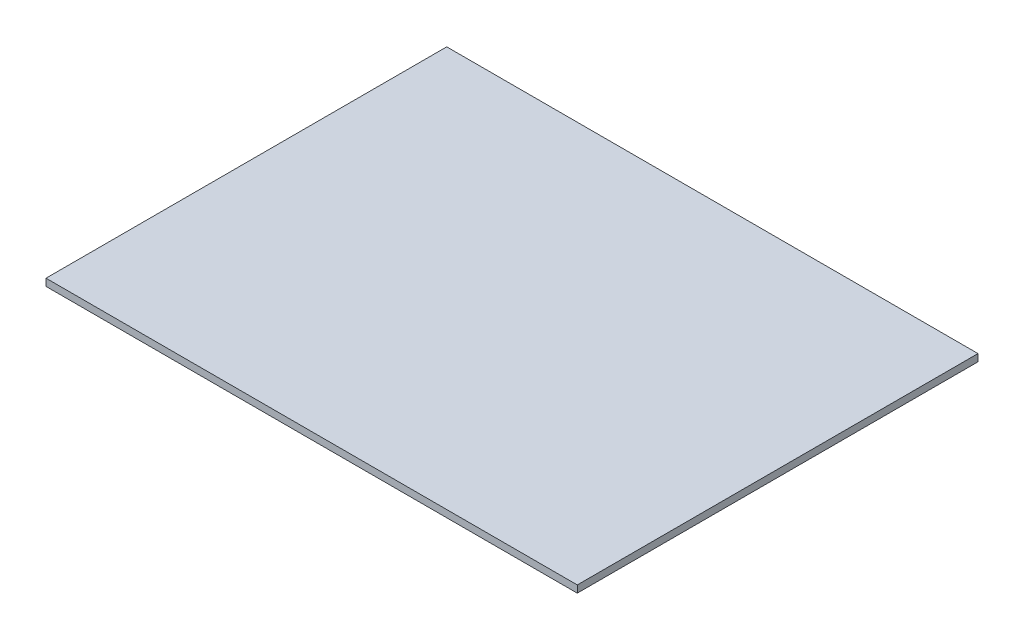
ISO-10303-21;
HEADER;
FILE_DESCRIPTION(('STEP AP214'),'2;1');
FILE_NAME('part.step','',(''),(''),'','','');
FILE_SCHEMA(('AUTOMOTIVE_DESIGN { 1 0 10303 214 1 1 1 1 }'));
ENDSEC;
DATA;
#1=APPLICATION_CONTEXT('core data for automotive mechanical design processes');
#2=APPLICATION_PROTOCOL_DEFINITION('international standard','automotive_design',2000,#1);
#3=PRODUCT_CONTEXT('',#1,'mechanical');
#4=PRODUCT('Part','Part','',(#3));
#5=PRODUCT_RELATED_PRODUCT_CATEGORY('part','',(#4));
#6=PRODUCT_DEFINITION_FORMATION('','',#4);
#7=PRODUCT_DEFINITION_CONTEXT('part definition',#1,'design');
#8=PRODUCT_DEFINITION('design','',#6,#7);
#9=PRODUCT_DEFINITION_SHAPE('','',#8);
#10=(LENGTH_UNIT() NAMED_UNIT(*) SI_UNIT(.MILLI.,.METRE.));
#11=(NAMED_UNIT(*) PLANE_ANGLE_UNIT() SI_UNIT($,.RADIAN.));
#12=(NAMED_UNIT(*) SI_UNIT($,.STERADIAN.) SOLID_ANGLE_UNIT());
#13=UNCERTAINTY_MEASURE_WITH_UNIT(LENGTH_MEASURE(1.E-05),#10,'distance_accuracy_value','');
#14=(GEOMETRIC_REPRESENTATION_CONTEXT(3) GLOBAL_UNCERTAINTY_ASSIGNED_CONTEXT((#13)) GLOBAL_UNIT_ASSIGNED_CONTEXT((#10,
#11,#12)) REPRESENTATION_CONTEXT('',''));
#15=CARTESIAN_POINT('',(0.,0.,0.));
#16=DIRECTION('',(0.,0.,1.));
#17=DIRECTION('',(1.,0.,0.));
#18=AXIS2_PLACEMENT_3D('',#15,#16,#17);
#19=CARTESIAN_POINT('',(0.,6.,0.));
#20=DIRECTION('',(1.,0.,0.));
#21=DIRECTION('',(0.,0.,-1.));
#22=AXIS2_PLACEMENT_3D('',#19,#20,#21);
#23=PLANE('',#22);
#24=DIRECTION('',(0.,0.,1.));
#25=VECTOR('',#24,1.);
#26=CARTESIAN_POINT('',(0.,0.,0.));
#27=LINE('',#26,#25);
#28=CARTESIAN_POINT('',(0.,0.,-336.4));
#29=VERTEX_POINT('',#28);
#30=CARTESIAN_POINT('',(0.,0.,0.));
#31=VERTEX_POINT('',#30);
#32=EDGE_CURVE('E114',#29,#31,#27,.T.);
#33=ORIENTED_EDGE('',*,*,#32,.T.);
#34=DIRECTION('',(0.,-1.,0.));
#35=VECTOR('',#34,1.);
#36=CARTESIAN_POINT('',(0.,6.,0.));
#37=LINE('',#36,#35);
#38=CARTESIAN_POINT('',(0.,6.,0.));
#39=VERTEX_POINT('',#38);
#40=EDGE_CURVE('E11',#39,#31,#37,.T.);
#41=ORIENTED_EDGE('',*,*,#40,.F.);
#42=DIRECTION('',(0.,0.,1.));
#43=VECTOR('',#42,1.);
#44=CARTESIAN_POINT('',(0.,6.,0.));
#45=LINE('',#44,#43);
#46=CARTESIAN_POINT('',(0.,6.,-336.4));
#47=VERTEX_POINT('',#46);
#48=EDGE_CURVE('E98',#47,#39,#45,.T.);
#49=ORIENTED_EDGE('',*,*,#48,.F.);
#50=DIRECTION('',(0.,-1.,0.));
#51=VECTOR('',#50,1.);
#52=CARTESIAN_POINT('',(0.,6.,-336.4));
#53=LINE('',#52,#51);
#54=EDGE_CURVE('E110',#47,#29,#53,.T.);
#55=ORIENTED_EDGE('',*,*,#54,.T.);
#56=EDGE_LOOP('',(#33,#41,#49,#55));
#57=FACE_BOUND('',#56,.T.);
#58=ADVANCED_FACE('F46',(#57),#23,.F.);
#59=CARTESIAN_POINT('',(0.,6.,0.));
#60=DIRECTION('',(0.,0.,-1.));
#61=DIRECTION('',(-1.,0.,0.));
#62=AXIS2_PLACEMENT_3D('',#59,#60,#61);
#63=PLANE('',#62);
#64=DIRECTION('',(1.,0.,0.));
#65=VECTOR('',#64,1.);
#66=CARTESIAN_POINT('',(0.,0.,0.));
#67=LINE('',#66,#65);
#68=CARTESIAN_POINT('',(446.,0.,0.));
#69=VERTEX_POINT('',#68);
#70=EDGE_CURVE('E103',#31,#69,#67,.T.);
#71=ORIENTED_EDGE('',*,*,#70,.T.);
#72=DIRECTION('',(0.,-1.,0.));
#73=VECTOR('',#72,1.);
#74=CARTESIAN_POINT('',(446.,6.,0.));
#75=LINE('',#74,#73);
#76=CARTESIAN_POINT('',(446.,6.,0.));
#77=VERTEX_POINT('',#76);
#78=EDGE_CURVE('E55',#77,#69,#75,.T.);
#79=ORIENTED_EDGE('',*,*,#78,.F.);
#80=DIRECTION('',(1.,0.,0.));
#81=VECTOR('',#80,1.);
#82=CARTESIAN_POINT('',(0.,6.,0.));
#83=LINE('',#82,#81);
#84=EDGE_CURVE('E93',#39,#77,#83,.T.);
#85=ORIENTED_EDGE('',*,*,#84,.F.);
#86=ORIENTED_EDGE('',*,*,#40,.T.);
#87=EDGE_LOOP('',(#71,#79,#85,#86));
#88=FACE_BOUND('',#87,.T.);
#89=ADVANCED_FACE('F102',(#88),#63,.F.);
#90=CARTESIAN_POINT('',(446.,6.,0.));
#91=DIRECTION('',(-1.,0.,0.));
#92=DIRECTION('',(0.,0.,1.));
#93=AXIS2_PLACEMENT_3D('',#90,#91,#92);
#94=PLANE('',#93);
#95=DIRECTION('',(0.,0.,-1.));
#96=VECTOR('',#95,1.);
#97=CARTESIAN_POINT('',(446.,0.,0.));
#98=LINE('',#97,#96);
#99=CARTESIAN_POINT('',(446.,0.,-336.4));
#100=VERTEX_POINT('',#99);
#101=EDGE_CURVE('E80',#69,#100,#98,.T.);
#102=ORIENTED_EDGE('',*,*,#101,.T.);
#103=DIRECTION('',(0.,-1.,0.));
#104=VECTOR('',#103,1.);
#105=CARTESIAN_POINT('',(446.,6.,-336.4));
#106=LINE('',#105,#104);
#107=CARTESIAN_POINT('',(446.,6.,-336.4));
#108=VERTEX_POINT('',#107);
#109=EDGE_CURVE('E105',#108,#100,#106,.T.);
#110=ORIENTED_EDGE('',*,*,#109,.F.);
#111=DIRECTION('',(0.,0.,-1.));
#112=VECTOR('',#111,1.);
#113=CARTESIAN_POINT('',(446.,6.,0.));
#114=LINE('',#113,#112);
#115=EDGE_CURVE('E96',#77,#108,#114,.T.);
#116=ORIENTED_EDGE('',*,*,#115,.F.);
#117=ORIENTED_EDGE('',*,*,#78,.T.);
#118=EDGE_LOOP('',(#102,#110,#116,#117));
#119=FACE_BOUND('',#118,.T.);
#120=ADVANCED_FACE('F106',(#119),#94,.F.);
#121=CARTESIAN_POINT('',(0.,6.,-336.4));
#122=DIRECTION('',(0.,0.,1.));
#123=DIRECTION('',(1.,0.,0.));
#124=AXIS2_PLACEMENT_3D('',#121,#122,#123);
#125=PLANE('',#124);
#126=DIRECTION('',(-1.,0.,0.));
#127=VECTOR('',#126,1.);
#128=CARTESIAN_POINT('',(0.,0.,-336.4));
#129=LINE('',#128,#127);
#130=EDGE_CURVE('E86',#100,#29,#129,.T.);
#131=ORIENTED_EDGE('',*,*,#130,.T.);
#132=ORIENTED_EDGE('',*,*,#54,.F.);
#133=DIRECTION('',(-1.,0.,0.));
#134=VECTOR('',#133,1.);
#135=CARTESIAN_POINT('',(0.,6.,-336.4));
#136=LINE('',#135,#134);
#137=EDGE_CURVE('E63',#108,#47,#136,.T.);
#138=ORIENTED_EDGE('',*,*,#137,.F.);
#139=ORIENTED_EDGE('',*,*,#109,.T.);
#140=EDGE_LOOP('',(#131,#132,#138,#139));
#141=FACE_BOUND('',#140,.T.);
#142=ADVANCED_FACE('F127',(#141),#125,.F.);
#143=CARTESIAN_POINT('',(0.,6.,0.));
#144=DIRECTION('',(0.,-1.,0.));
#145=DIRECTION('',(0.,0.,-1.));
#146=AXIS2_PLACEMENT_3D('',#143,#144,#145);
#147=PLANE('',#146);
#148=ORIENTED_EDGE('',*,*,#48,.T.);
#149=ORIENTED_EDGE('',*,*,#84,.T.);
#150=ORIENTED_EDGE('',*,*,#115,.T.);
#151=ORIENTED_EDGE('',*,*,#137,.T.);
#152=EDGE_LOOP('',(#148,#149,#150,#151));
#153=FACE_BOUND('',#152,.T.);
#154=ADVANCED_FACE('F94',(#153),#147,.F.);
#155=CARTESIAN_POINT('',(0.,0.,0.));
#156=DIRECTION('',(0.,-1.,0.));
#157=DIRECTION('',(0.,0.,-1.));
#158=AXIS2_PLACEMENT_3D('',#155,#156,#157);
#159=PLANE('',#158);
#160=ORIENTED_EDGE('',*,*,#32,.F.);
#161=ORIENTED_EDGE('',*,*,#130,.F.);
#162=ORIENTED_EDGE('',*,*,#101,.F.);
#163=ORIENTED_EDGE('',*,*,#70,.F.);
#164=EDGE_LOOP('',(#160,#161,#162,#163));
#165=FACE_BOUND('',#164,.T.);
#166=ADVANCED_FACE('F130',(#165),#159,.T.);
#167=CLOSED_SHELL('',(#58,#89,#120,#142,#154,#166));
#168=MANIFOLD_SOLID_BREP('B2',#167);
#169=ADVANCED_BREP_SHAPE_REPRESENTATION('',(#18,#168),#14);
#170=SHAPE_DEFINITION_REPRESENTATION(#9,#169);
ENDSEC;
END-ISO-10303-21;
